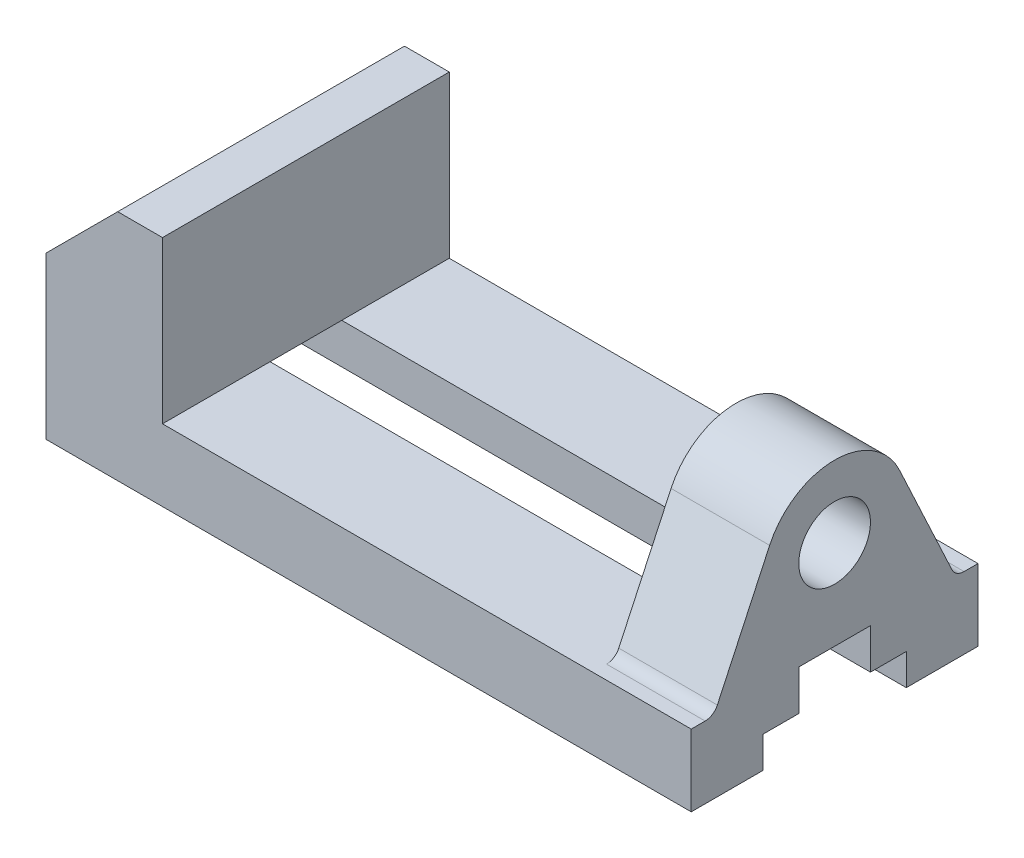
ISO-10303-21;
HEADER;
FILE_DESCRIPTION(('STEP AP214'),'2;1');
FILE_NAME('part.step','',(''),(''),'','','');
FILE_SCHEMA(('AUTOMOTIVE_DESIGN { 1 0 10303 214 1 1 1 1 }'));
ENDSEC;
DATA;
#1=APPLICATION_CONTEXT('core data for automotive mechanical design processes');
#2=APPLICATION_PROTOCOL_DEFINITION('international standard','automotive_design',2000,#1);
#3=PRODUCT_CONTEXT('',#1,'mechanical');
#4=PRODUCT('Part','Part','',(#3));
#5=PRODUCT_RELATED_PRODUCT_CATEGORY('part','',(#4));
#6=PRODUCT_DEFINITION_FORMATION('','',#4);
#7=PRODUCT_DEFINITION_CONTEXT('part definition',#1,'design');
#8=PRODUCT_DEFINITION('design','',#6,#7);
#9=PRODUCT_DEFINITION_SHAPE('','',#8);
#10=(LENGTH_UNIT() NAMED_UNIT(*) SI_UNIT(.MILLI.,.METRE.));
#11=(NAMED_UNIT(*) PLANE_ANGLE_UNIT() SI_UNIT($,.RADIAN.));
#12=(NAMED_UNIT(*) SI_UNIT($,.STERADIAN.) SOLID_ANGLE_UNIT());
#13=UNCERTAINTY_MEASURE_WITH_UNIT(LENGTH_MEASURE(1.E-05),#10,'distance_accuracy_value','');
#14=(GEOMETRIC_REPRESENTATION_CONTEXT(3) GLOBAL_UNCERTAINTY_ASSIGNED_CONTEXT((#13)) GLOBAL_UNIT_ASSIGNED_CONTEXT((#10,
#11,#12)) REPRESENTATION_CONTEXT('',''));
#15=CARTESIAN_POINT('',(0.,0.,0.));
#16=DIRECTION('',(0.,0.,1.));
#17=DIRECTION('',(1.,0.,0.));
#18=AXIS2_PLACEMENT_3D('',#15,#16,#17);
#19=CARTESIAN_POINT('',(0.,0.,64.));
#20=DIRECTION('',(0.,1.,0.));
#21=DIRECTION('',(0.,0.,1.));
#22=AXIS2_PLACEMENT_3D('',#19,#20,#21);
#23=PLANE('',#22);
#24=CARTESIAN_POINT('',(106.,0.,54.));
#25=DIRECTION('',(0.,-1.,0.));
#26=DIRECTION('',(0.,0.,-1.));
#27=AXIS2_PLACEMENT_3D('',#24,#25,#26);
#28=CIRCLE('',#27,3.00000000000001);
#29=CARTESIAN_POINT('',(106.,0.,51.));
#30=VERTEX_POINT('',#29);
#31=EDGE_CURVE('E417',#30,#30,#28,.T.);
#32=ORIENTED_EDGE('',*,*,#31,.F.);
#33=EDGE_LOOP('',(#32));
#34=FACE_BOUND('',#33,.T.);
#35=CARTESIAN_POINT('',(36.,0.,54.));
#36=DIRECTION('',(0.,-1.,0.));
#37=DIRECTION('',(0.,0.,-1.));
#38=AXIS2_PLACEMENT_3D('',#35,#36,#37);
#39=CIRCLE('',#38,3.);
#40=CARTESIAN_POINT('',(36.,0.,51.));
#41=VERTEX_POINT('',#40);
#42=EDGE_CURVE('E414',#41,#41,#39,.T.);
#43=ORIENTED_EDGE('',*,*,#42,.F.);
#44=EDGE_LOOP('',(#43));
#45=FACE_BOUND('',#44,.T.);
#46=DIRECTION('',(0.,0.,-1.));
#47=VECTOR('',#46,1.);
#48=CARTESIAN_POINT('',(0.,0.,64.));
#49=LINE('',#48,#47);
#50=CARTESIAN_POINT('',(0.,0.,64.));
#51=VERTEX_POINT('',#50);
#52=CARTESIAN_POINT('',(0.,0.,48.));
#53=VERTEX_POINT('',#52);
#54=EDGE_CURVE('E251',#51,#53,#49,.T.);
#55=ORIENTED_EDGE('',*,*,#54,.T.);
#56=DIRECTION('',(1.,0.,0.));
#57=VECTOR('',#56,1.);
#58=CARTESIAN_POINT('',(-0.001000000000001,0.,48.));
#59=LINE('',#58,#57);
#60=CARTESIAN_POINT('',(144.,0.,48.));
#61=VERTEX_POINT('',#60);
#62=EDGE_CURVE('E233',#53,#61,#59,.T.);
#63=ORIENTED_EDGE('',*,*,#62,.T.);
#64=DIRECTION('',(0.,0.,-1.));
#65=VECTOR('',#64,1.);
#66=CARTESIAN_POINT('',(144.,0.,64.));
#67=LINE('',#66,#65);
#68=CARTESIAN_POINT('',(144.,0.,64.));
#69=VERTEX_POINT('',#68);
#70=EDGE_CURVE('E260',#69,#61,#67,.T.);
#71=ORIENTED_EDGE('',*,*,#70,.F.);
#72=DIRECTION('',(1.,0.,0.));
#73=VECTOR('',#72,1.);
#74=CARTESIAN_POINT('',(0.,0.,64.));
#75=LINE('',#74,#73);
#76=EDGE_CURVE('E256',#51,#69,#75,.T.);
#77=ORIENTED_EDGE('',*,*,#76,.F.);
#78=EDGE_LOOP('',(#55,#63,#71,#77));
#79=FACE_BOUND('',#78,.T.);
#80=ADVANCED_FACE('F79',(#34,#45,#79),#23,.F.);
#81=CARTESIAN_POINT('',(122.,16.,64.));
#82=DIRECTION('',(0.,-1.,0.));
#83=DIRECTION('',(1.,0.,0.));
#84=AXIS2_PLACEMENT_3D('',#81,#82,#83);
#85=PLANE('',#84);
#86=DIRECTION('',(0.,0.,-1.));
#87=VECTOR('',#86,1.);
#88=CARTESIAN_POINT('',(122.,16.,64.));
#89=LINE('',#88,#87);
#90=CARTESIAN_POINT('',(122.,16.,60.8914106489224));
#91=VERTEX_POINT('',#90);
#92=CARTESIAN_POINT('',(122.,16.,40.));
#93=VERTEX_POINT('',#92);
#94=EDGE_CURVE('E264',#91,#93,#89,.T.);
#95=ORIENTED_EDGE('',*,*,#94,.T.);
#96=DIRECTION('',(1.,0.,0.));
#97=VECTOR('',#96,1.);
#98=CARTESIAN_POINT('',(-0.001000000000001,16.,40.));
#99=LINE('',#98,#97);
#100=CARTESIAN_POINT('',(26.,16.,40.));
#101=VERTEX_POINT('',#100);
#102=EDGE_CURVE('E379',#101,#93,#99,.T.);
#103=ORIENTED_EDGE('',*,*,#102,.F.);
#104=DIRECTION('',(0.,0.,-1.));
#105=VECTOR('',#104,1.);
#106=CARTESIAN_POINT('',(26.,16.,64.));
#107=LINE('',#106,#105);
#108=CARTESIAN_POINT('',(26.,16.,64.));
#109=VERTEX_POINT('',#108);
#110=EDGE_CURVE('E268',#109,#101,#107,.T.);
#111=ORIENTED_EDGE('',*,*,#110,.F.);
#112=DIRECTION('',(-1.,0.,0.));
#113=VECTOR('',#112,1.);
#114=CARTESIAN_POINT('',(122.,16.,64.));
#115=LINE('',#114,#113);
#116=CARTESIAN_POINT('',(144.,16.,64.));
#117=VERTEX_POINT('',#116);
#118=EDGE_CURVE('E308',#117,#109,#115,.T.);
#119=ORIENTED_EDGE('',*,*,#118,.F.);
#120=DIRECTION('',(0.,0.,-1.));
#121=VECTOR('',#120,1.);
#122=CARTESIAN_POINT('',(144.,16.,0.));
#123=LINE('',#122,#121);
#124=CARTESIAN_POINT('',(144.,16.,60.8914106489224));
#125=VERTEX_POINT('',#124);
#126=EDGE_CURVE('E332',#117,#125,#123,.T.);
#127=ORIENTED_EDGE('',*,*,#126,.T.);
#128=DIRECTION('',(1.,0.,0.));
#129=VECTOR('',#128,1.);
#130=CARTESIAN_POINT('',(80.,16.,60.8914106489224));
#131=LINE('',#130,#129);
#132=EDGE_CURVE('E318',#91,#125,#131,.T.);
#133=ORIENTED_EDGE('',*,*,#132,.F.);
#134=EDGE_LOOP('',(#95,#103,#111,#119,#127,#133));
#135=FACE_BOUND('',#134,.T.);
#136=ADVANCED_FACE('F493',(#135),#85,.F.);
#137=CARTESIAN_POINT('',(122.,52.,64.));
#138=DIRECTION('',(1.,0.,0.));
#139=DIRECTION('',(0.,0.,-1.));
#140=AXIS2_PLACEMENT_3D('',#137,#138,#139);
#141=PLANE('',#140);
#142=CARTESIAN_POINT('',(122.,36.,32.));
#143=DIRECTION('',(1.,0.,0.));
#144=DIRECTION('',(0.,0.,-1.));
#145=AXIS2_PLACEMENT_3D('',#142,#143,#144);
#146=CIRCLE('',#145,8.);
#147=CARTESIAN_POINT('',(122.,36.,24.));
#148=VERTEX_POINT('',#147);
#149=EDGE_CURVE('E335',#148,#148,#146,.T.);
#150=ORIENTED_EDGE('',*,*,#149,.T.);
#151=EDGE_LOOP('',(#150));
#152=FACE_BOUND('',#151,.T.);
#153=CARTESIAN_POINT('',(122.,19.,3.10858935107765));
#154=DIRECTION('',(1.,0.,0.));
#155=DIRECTION('',(0.,0.,-1.));
#156=AXIS2_PLACEMENT_3D('',#153,#154,#155);
#157=CIRCLE('',#156,3.);
#158=CARTESIAN_POINT('',(122.,16.,3.10858935107763));
#159=VERTEX_POINT('',#158);
#160=CARTESIAN_POINT('',(122.,17.7321452147779,5.8275127121876));
#161=VERTEX_POINT('',#160);
#162=EDGE_CURVE('E341',#159,#161,#157,.F.);
#163=ORIENTED_EDGE('',*,*,#162,.F.);
#164=CARTESIAN_POINT('',(122.,16.,24.));
#165=VERTEX_POINT('',#164);
#166=EDGE_CURVE('E267',#165,#159,#89,.T.);
#167=ORIENTED_EDGE('',*,*,#166,.F.);
#168=DIRECTION('',(0.,0.,1.));
#169=VECTOR('',#168,1.);
#170=CARTESIAN_POINT('',(122.,16.,64.));
#171=LINE('',#170,#169);
#172=EDGE_CURVE('E362',#165,#93,#171,.T.);
#173=ORIENTED_EDGE('',*,*,#172,.T.);
#174=ORIENTED_EDGE('',*,*,#94,.F.);
#175=CARTESIAN_POINT('',(122.,19.,60.8914106489224));
#176=DIRECTION('',(1.,0.,0.));
#177=DIRECTION('',(0.,0.,-1.));
#178=AXIS2_PLACEMENT_3D('',#175,#176,#177);
#179=CIRCLE('',#178,3.);
#180=CARTESIAN_POINT('',(122.,17.7321452147779,58.1724872878124));
#181=VERTEX_POINT('',#180);
#182=EDGE_CURVE('E302',#91,#181,#179,.T.);
#183=ORIENTED_EDGE('',*,*,#182,.T.);
#184=DIRECTION('',(0.,-0.906307787036649,0.422618261740701));
#185=VECTOR('',#184,1.);
#186=CARTESIAN_POINT('',(122.,43.6474819754398,46.08796729265));
#187=LINE('',#186,#185);
#188=CARTESIAN_POINT('',(122.,42.7618921878512,46.5009245925864));
#189=VERTEX_POINT('',#188);
#190=EDGE_CURVE('E87',#189,#181,#187,.T.);
#191=ORIENTED_EDGE('',*,*,#190,.F.);
#192=CARTESIAN_POINT('',(122.,36.,32.));
#193=DIRECTION('',(1.,0.,0.));
#194=DIRECTION('',(0.,0.,-1.));
#195=AXIS2_PLACEMENT_3D('',#192,#193,#194);
#196=CIRCLE('',#195,16.);
#197=CARTESIAN_POINT('',(122.,42.7618921878512,17.4990754074136));
#198=VERTEX_POINT('',#197);
#199=EDGE_CURVE('E12',#198,#189,#196,.T.);
#200=ORIENTED_EDGE('',*,*,#199,.F.);
#201=DIRECTION('',(0.,-0.906307787036649,-0.422618261740701));
#202=VECTOR('',#201,1.);
#203=CARTESIAN_POINT('',(122.,68.1609041552472,29.3428291973809));
#204=LINE('',#203,#202);
#205=EDGE_CURVE('E338',#198,#161,#204,.T.);
#206=ORIENTED_EDGE('',*,*,#205,.T.);
#207=EDGE_LOOP('',(#163,#167,#173,#174,#183,#191,#200,#206));
#208=FACE_BOUND('',#207,.T.);
#209=ADVANCED_FACE('F542',(#152,#208),#141,.F.);
#210=CARTESIAN_POINT('',(144.,0.,64.));
#211=DIRECTION('',(-1.,0.,0.));
#212=DIRECTION('',(0.,0.,1.));
#213=AXIS2_PLACEMENT_3D('',#210,#211,#212);
#214=PLANE('',#213);
#215=CARTESIAN_POINT('',(144.,36.,32.));
#216=DIRECTION('',(1.,0.,0.));
#217=DIRECTION('',(0.,0.,-1.));
#218=AXIS2_PLACEMENT_3D('',#215,#216,#217);
#219=CIRCLE('',#218,8.);
#220=CARTESIAN_POINT('',(144.,36.,24.));
#221=VERTEX_POINT('',#220);
#222=EDGE_CURVE('E359',#221,#221,#219,.T.);
#223=ORIENTED_EDGE('',*,*,#222,.F.);
#224=EDGE_LOOP('',(#223));
#225=FACE_BOUND('',#224,.T.);
#226=DIRECTION('',(0.,0.,1.));
#227=VECTOR('',#226,1.);
#228=CARTESIAN_POINT('',(144.,7.,24.));
#229=LINE('',#228,#227);
#230=CARTESIAN_POINT('',(144.,7.,16.));
#231=VERTEX_POINT('',#230);
#232=CARTESIAN_POINT('',(144.,7.,24.));
#233=VERTEX_POINT('',#232);
#234=EDGE_CURVE('E393',#231,#233,#229,.T.);
#235=ORIENTED_EDGE('',*,*,#234,.F.);
#236=DIRECTION('',(0.,1.,0.));
#237=VECTOR('',#236,1.);
#238=CARTESIAN_POINT('',(144.,0.,16.));
#239=LINE('',#238,#237);
#240=CARTESIAN_POINT('',(144.,0.,16.));
#241=VERTEX_POINT('',#240);
#242=EDGE_CURVE('E396',#241,#231,#239,.T.);
#243=ORIENTED_EDGE('',*,*,#242,.F.);
#244=CARTESIAN_POINT('',(144.,0.,0.));
#245=VERTEX_POINT('',#244);
#246=EDGE_CURVE('E263',#241,#245,#67,.T.);
#247=ORIENTED_EDGE('',*,*,#246,.T.);
#248=DIRECTION('',(0.,1.,0.));
#249=VECTOR('',#248,1.);
#250=CARTESIAN_POINT('',(144.,0.,0.));
#251=LINE('',#250,#249);
#252=CARTESIAN_POINT('',(144.,16.,0.));
#253=VERTEX_POINT('',#252);
#254=EDGE_CURVE('E293',#245,#253,#251,.T.);
#255=ORIENTED_EDGE('',*,*,#254,.T.);
#256=DIRECTION('',(0.,0.,-1.));
#257=VECTOR('',#256,1.);
#258=CARTESIAN_POINT('',(144.,16.,0.));
#259=LINE('',#258,#257);
#260=CARTESIAN_POINT('',(144.,16.,3.10858935107763));
#261=VERTEX_POINT('',#260);
#262=EDGE_CURVE('E353',#261,#253,#259,.T.);
#263=ORIENTED_EDGE('',*,*,#262,.F.);
#264=CARTESIAN_POINT('',(144.,19.,3.10858935107765));
#265=DIRECTION('',(1.,0.,0.));
#266=DIRECTION('',(0.,0.,-1.));
#267=AXIS2_PLACEMENT_3D('',#264,#265,#266);
#268=CIRCLE('',#267,3.);
#269=CARTESIAN_POINT('',(144.,17.7321452147779,5.8275127121876));
#270=VERTEX_POINT('',#269);
#271=EDGE_CURVE('E356',#261,#270,#268,.F.);
#272=ORIENTED_EDGE('',*,*,#271,.T.);
#273=DIRECTION('',(0.,-0.906307787036649,-0.422618261740701));
#274=VECTOR('',#273,1.);
#275=CARTESIAN_POINT('',(144.,0.93500412358986,-2.00512281374342));
#276=LINE('',#275,#274);
#277=CARTESIAN_POINT('',(144.,42.7618921878512,17.4990754074136));
#278=VERTEX_POINT('',#277);
#279=EDGE_CURVE('E347',#278,#270,#276,.T.);
#280=ORIENTED_EDGE('',*,*,#279,.F.);
#281=CARTESIAN_POINT('',(144.,36.,32.));
#282=DIRECTION('',(1.,0.,0.));
#283=DIRECTION('',(0.,0.,-1.));
#284=AXIS2_PLACEMENT_3D('',#281,#282,#283);
#285=CIRCLE('',#284,16.);
#286=CARTESIAN_POINT('',(144.,42.7618921878512,46.5009245925864));
#287=VERTEX_POINT('',#286);
#288=EDGE_CURVE('E321',#278,#287,#285,.T.);
#289=ORIENTED_EDGE('',*,*,#288,.T.);
#290=DIRECTION('',(0.,-0.906307787036649,0.422618261740701));
#291=VECTOR('',#290,1.);
#292=CARTESIAN_POINT('',(144.,25.4484263033972,54.5743263237126));
#293=LINE('',#292,#291);
#294=CARTESIAN_POINT('',(144.,17.7321452147779,58.1724872878124));
#295=VERTEX_POINT('',#294);
#296=EDGE_CURVE('E326',#287,#295,#293,.T.);
#297=ORIENTED_EDGE('',*,*,#296,.T.);
#298=CARTESIAN_POINT('',(144.,19.,60.8914106489224));
#299=DIRECTION('',(1.,0.,0.));
#300=DIRECTION('',(0.,0.,-1.));
#301=AXIS2_PLACEMENT_3D('',#298,#299,#300);
#302=CIRCLE('',#301,3.);
#303=EDGE_CURVE('E329',#125,#295,#302,.T.);
#304=ORIENTED_EDGE('',*,*,#303,.F.);
#305=ORIENTED_EDGE('',*,*,#126,.F.);
#306=DIRECTION('',(0.,1.,0.));
#307=VECTOR('',#306,1.);
#308=CARTESIAN_POINT('',(144.,0.,64.));
#309=LINE('',#308,#307);
#310=EDGE_CURVE('E310',#69,#117,#309,.T.);
#311=ORIENTED_EDGE('',*,*,#310,.F.);
#312=ORIENTED_EDGE('',*,*,#70,.T.);
#313=DIRECTION('',(0.,-1.,0.));
#314=VECTOR('',#313,1.);
#315=CARTESIAN_POINT('',(144.,0.,48.));
#316=LINE('',#315,#314);
#317=CARTESIAN_POINT('',(144.,7.,48.));
#318=VERTEX_POINT('',#317);
#319=EDGE_CURVE('E239',#318,#61,#316,.T.);
#320=ORIENTED_EDGE('',*,*,#319,.F.);
#321=DIRECTION('',(0.,0.,1.));
#322=VECTOR('',#321,1.);
#323=CARTESIAN_POINT('',(144.,7.,48.));
#324=LINE('',#323,#322);
#325=CARTESIAN_POINT('',(144.,7.,40.));
#326=VERTEX_POINT('',#325);
#327=EDGE_CURVE('E245',#326,#318,#324,.T.);
#328=ORIENTED_EDGE('',*,*,#327,.F.);
#329=DIRECTION('',(0.,-1.,0.));
#330=VECTOR('',#329,1.);
#331=CARTESIAN_POINT('',(144.,7.,40.));
#332=LINE('',#331,#330);
#333=CARTESIAN_POINT('',(144.,16.,40.));
#334=VERTEX_POINT('',#333);
#335=EDGE_CURVE('E384',#334,#326,#332,.T.);
#336=ORIENTED_EDGE('',*,*,#335,.F.);
#337=DIRECTION('',(0.,0.,1.));
#338=VECTOR('',#337,1.);
#339=CARTESIAN_POINT('',(144.,16.,40.));
#340=LINE('',#339,#338);
#341=CARTESIAN_POINT('',(144.,16.,24.));
#342=VERTEX_POINT('',#341);
#343=EDGE_CURVE('E387',#342,#334,#340,.T.);
#344=ORIENTED_EDGE('',*,*,#343,.F.);
#345=DIRECTION('',(0.,1.,0.));
#346=VECTOR('',#345,1.);
#347=CARTESIAN_POINT('',(144.,16.,24.));
#348=LINE('',#347,#346);
#349=EDGE_CURVE('E390',#233,#342,#348,.T.);
#350=ORIENTED_EDGE('',*,*,#349,.F.);
#351=EDGE_LOOP('',(#235,#243,#247,#255,#263,#272,#280,#289,#297,#304,#305,#311,#312,#320,#328,
#336,#344,#350));
#352=FACE_BOUND('',#351,.T.);
#353=ADVANCED_FACE('F451',(#225,#352),#214,.F.);
#354=CARTESIAN_POINT('',(0.,36.,64.));
#355=DIRECTION('',(1.,0.,0.));
#356=DIRECTION('',(0.,1.,0.));
#357=AXIS2_PLACEMENT_3D('',#354,#355,#356);
#358=PLANE('',#357);
#359=CARTESIAN_POINT('',(0.,0.,16.));
#360=VERTEX_POINT('',#359);
#361=CARTESIAN_POINT('',(0.,0.,0.));
#362=VERTEX_POINT('',#361);
#363=EDGE_CURVE('E258',#360,#362,#49,.T.);
#364=ORIENTED_EDGE('',*,*,#363,.F.);
#365=DIRECTION('',(0.,-1.,0.));
#366=VECTOR('',#365,1.);
#367=CARTESIAN_POINT('',(0.,0.,16.));
#368=LINE('',#367,#366);
#369=CARTESIAN_POINT('',(0.,7.,16.));
#370=VERTEX_POINT('',#369);
#371=EDGE_CURVE('E94',#370,#360,#368,.T.);
#372=ORIENTED_EDGE('',*,*,#371,.F.);
#373=DIRECTION('',(0.,0.,-1.));
#374=VECTOR('',#373,1.);
#375=CARTESIAN_POINT('',(0.,7.,24.));
#376=LINE('',#375,#374);
#377=CARTESIAN_POINT('',(0.,7.,24.));
#378=VERTEX_POINT('',#377);
#379=EDGE_CURVE('E409',#378,#370,#376,.T.);
#380=ORIENTED_EDGE('',*,*,#379,.F.);
#381=DIRECTION('',(0.,-1.,0.));
#382=VECTOR('',#381,1.);
#383=CARTESIAN_POINT('',(0.,16.,24.));
#384=LINE('',#383,#382);
#385=CARTESIAN_POINT('',(0.,16.,24.));
#386=VERTEX_POINT('',#385);
#387=EDGE_CURVE('E406',#386,#378,#384,.T.);
#388=ORIENTED_EDGE('',*,*,#387,.F.);
#389=DIRECTION('',(0.,0.,-1.));
#390=VECTOR('',#389,1.);
#391=CARTESIAN_POINT('',(0.,16.,40.));
#392=LINE('',#391,#390);
#393=CARTESIAN_POINT('',(0.,16.,40.));
#394=VERTEX_POINT('',#393);
#395=EDGE_CURVE('E404',#394,#386,#392,.T.);
#396=ORIENTED_EDGE('',*,*,#395,.F.);
#397=DIRECTION('',(0.,1.,0.));
#398=VECTOR('',#397,1.);
#399=CARTESIAN_POINT('',(0.,7.,40.));
#400=LINE('',#399,#398);
#401=CARTESIAN_POINT('',(0.,7.,40.));
#402=VERTEX_POINT('',#401);
#403=EDGE_CURVE('E401',#402,#394,#400,.T.);
#404=ORIENTED_EDGE('',*,*,#403,.F.);
#405=DIRECTION('',(0.,0.,-1.));
#406=VECTOR('',#405,1.);
#407=CARTESIAN_POINT('',(0.,7.,48.));
#408=LINE('',#407,#406);
#409=CARTESIAN_POINT('',(0.,7.,48.));
#410=VERTEX_POINT('',#409);
#411=EDGE_CURVE('E254',#410,#402,#408,.T.);
#412=ORIENTED_EDGE('',*,*,#411,.F.);
#413=DIRECTION('',(0.,1.,0.));
#414=VECTOR('',#413,1.);
#415=CARTESIAN_POINT('',(0.,0.,48.));
#416=LINE('',#415,#414);
#417=EDGE_CURVE('E236',#53,#410,#416,.T.);
#418=ORIENTED_EDGE('',*,*,#417,.F.);
#419=ORIENTED_EDGE('',*,*,#54,.F.);
#420=DIRECTION('',(0.,-1.,0.));
#421=VECTOR('',#420,1.);
#422=CARTESIAN_POINT('',(0.,36.,64.));
#423=LINE('',#422,#421);
#424=CARTESIAN_POINT('',(0.,36.,64.));
#425=VERTEX_POINT('',#424);
#426=EDGE_CURVE('E285',#425,#51,#423,.T.);
#427=ORIENTED_EDGE('',*,*,#426,.F.);
#428=DIRECTION('',(0.,0.,-1.));
#429=VECTOR('',#428,1.);
#430=CARTESIAN_POINT('',(0.,36.,64.));
#431=LINE('',#430,#429);
#432=CARTESIAN_POINT('',(0.,36.,0.));
#433=VERTEX_POINT('',#432);
#434=EDGE_CURVE('E279',#425,#433,#431,.T.);
#435=ORIENTED_EDGE('',*,*,#434,.T.);
#436=DIRECTION('',(0.,-1.,0.));
#437=VECTOR('',#436,1.);
#438=CARTESIAN_POINT('',(0.,36.,0.));
#439=LINE('',#438,#437);
#440=EDGE_CURVE('E299',#433,#362,#439,.T.);
#441=ORIENTED_EDGE('',*,*,#440,.T.);
#442=EDGE_LOOP('',(#364,#372,#380,#388,#396,#404,#412,#418,#419,#427,#435,#441));
#443=FACE_BOUND('',#442,.T.);
#444=ADVANCED_FACE('F81',(#443),#358,.F.);
#445=CARTESIAN_POINT('',(36.,0.,10.));
#446=DIRECTION('',(0.,-1.,0.));
#447=DIRECTION('',(0.,0.,-1.));
#448=AXIS2_PLACEMENT_3D('',#445,#446,#447);
#449=CIRCLE('',#448,3.);
#450=CARTESIAN_POINT('',(36.,0.,7.));
#451=VERTEX_POINT('',#450);
#452=EDGE_CURVE('E423',#451,#451,#449,.T.);
#453=ORIENTED_EDGE('',*,*,#452,.F.);
#454=EDGE_LOOP('',(#453));
#455=FACE_BOUND('',#454,.T.);
#456=CARTESIAN_POINT('',(106.,0.,10.));
#457=DIRECTION('',(0.,-1.,0.));
#458=DIRECTION('',(0.,0.,-1.));
#459=AXIS2_PLACEMENT_3D('',#456,#457,#458);
#460=CIRCLE('',#459,3.00000000000001);
#461=CARTESIAN_POINT('',(106.,0.,6.99999999999999));
#462=VERTEX_POINT('',#461);
#463=EDGE_CURVE('E424',#462,#462,#460,.T.);
#464=ORIENTED_EDGE('',*,*,#463,.F.);
#465=EDGE_LOOP('',(#464));
#466=FACE_BOUND('',#465,.T.);
#467=ORIENTED_EDGE('',*,*,#246,.F.);
#468=DIRECTION('',(1.,0.,0.));
#469=VECTOR('',#468,1.);
#470=CARTESIAN_POINT('',(-0.001000000000001,0.,16.));
#471=LINE('',#470,#469);
#472=EDGE_CURVE('E244',#360,#241,#471,.T.);
#473=ORIENTED_EDGE('',*,*,#472,.F.);
#474=ORIENTED_EDGE('',*,*,#363,.T.);
#475=DIRECTION('',(1.,0.,0.));
#476=VECTOR('',#475,1.);
#477=CARTESIAN_POINT('',(0.,0.,0.));
#478=LINE('',#477,#476);
#479=EDGE_CURVE('E296',#362,#245,#478,.T.);
#480=ORIENTED_EDGE('',*,*,#479,.T.);
#481=EDGE_LOOP('',(#467,#473,#474,#480));
#482=FACE_BOUND('',#481,.T.);
#483=ADVANCED_FACE('F440',(#455,#466,#482),#23,.F.);
#484=CARTESIAN_POINT('',(26.,16.,24.));
#485=VERTEX_POINT('',#484);
#486=CARTESIAN_POINT('',(26.,16.,0.));
#487=VERTEX_POINT('',#486);
#488=EDGE_CURVE('E272',#485,#487,#107,.T.);
#489=ORIENTED_EDGE('',*,*,#488,.F.);
#490=DIRECTION('',(1.,0.,0.));
#491=VECTOR('',#490,1.);
#492=CARTESIAN_POINT('',(-0.001000000000001,16.,24.));
#493=LINE('',#492,#491);
#494=EDGE_CURVE('E374',#485,#165,#493,.T.);
#495=ORIENTED_EDGE('',*,*,#494,.T.);
#496=ORIENTED_EDGE('',*,*,#166,.T.);
#497=DIRECTION('',(1.,0.,0.));
#498=VECTOR('',#497,1.);
#499=CARTESIAN_POINT('',(80.,16.,3.10858935107763));
#500=LINE('',#499,#498);
#501=EDGE_CURVE('E344',#159,#261,#500,.T.);
#502=ORIENTED_EDGE('',*,*,#501,.T.);
#503=ORIENTED_EDGE('',*,*,#262,.T.);
#504=DIRECTION('',(-1.,0.,0.));
#505=VECTOR('',#504,1.);
#506=CARTESIAN_POINT('',(122.,16.,0.));
#507=LINE('',#506,#505);
#508=EDGE_CURVE('E290',#253,#487,#507,.T.);
#509=ORIENTED_EDGE('',*,*,#508,.T.);
#510=EDGE_LOOP('',(#489,#495,#496,#502,#503,#509));
#511=FACE_BOUND('',#510,.T.);
#512=ADVANCED_FACE('F443',(#511),#85,.F.);
#513=CARTESIAN_POINT('',(26.,16.,64.));
#514=DIRECTION('',(-1.,0.,0.));
#515=DIRECTION('',(0.,0.,1.));
#516=AXIS2_PLACEMENT_3D('',#513,#514,#515);
#517=PLANE('',#516);
#518=DIRECTION('',(0.,1.,0.));
#519=VECTOR('',#518,1.);
#520=CARTESIAN_POINT('',(26.,16.,0.));
#521=LINE('',#520,#519);
#522=CARTESIAN_POINT('',(26.,52.,0.));
#523=VERTEX_POINT('',#522);
#524=EDGE_CURVE('E288',#487,#523,#521,.T.);
#525=ORIENTED_EDGE('',*,*,#524,.T.);
#526=DIRECTION('',(0.,0.,-1.));
#527=VECTOR('',#526,1.);
#528=CARTESIAN_POINT('',(26.,52.,64.));
#529=LINE('',#528,#527);
#530=CARTESIAN_POINT('',(26.,52.,64.));
#531=VERTEX_POINT('',#530);
#532=EDGE_CURVE('E273',#531,#523,#529,.T.);
#533=ORIENTED_EDGE('',*,*,#532,.F.);
#534=DIRECTION('',(0.,1.,0.));
#535=VECTOR('',#534,1.);
#536=CARTESIAN_POINT('',(26.,16.,64.));
#537=LINE('',#536,#535);
#538=EDGE_CURVE('E306',#109,#531,#537,.T.);
#539=ORIENTED_EDGE('',*,*,#538,.F.);
#540=ORIENTED_EDGE('',*,*,#110,.T.);
#541=EDGE_CURVE('E271',#101,#485,#107,.T.);
#542=ORIENTED_EDGE('',*,*,#541,.T.);
#543=ORIENTED_EDGE('',*,*,#488,.T.);
#544=EDGE_LOOP('',(#525,#533,#539,#540,#542,#543));
#545=FACE_BOUND('',#544,.T.);
#546=ADVANCED_FACE('F518',(#545),#517,.F.);
#547=CARTESIAN_POINT('',(26.,52.,64.));
#548=DIRECTION('',(0.,-1.,0.));
#549=DIRECTION('',(1.,0.,0.));
#550=AXIS2_PLACEMENT_3D('',#547,#548,#549);
#551=PLANE('',#550);
#552=DIRECTION('',(-1.,0.,0.));
#553=VECTOR('',#552,1.);
#554=CARTESIAN_POINT('',(26.,52.,0.));
#555=LINE('',#554,#553);
#556=CARTESIAN_POINT('',(16.,52.,0.));
#557=VERTEX_POINT('',#556);
#558=EDGE_CURVE('E286',#523,#557,#555,.T.);
#559=ORIENTED_EDGE('',*,*,#558,.T.);
#560=DIRECTION('',(0.,0.,-1.));
#561=VECTOR('',#560,1.);
#562=CARTESIAN_POINT('',(16.,52.,64.));
#563=LINE('',#562,#561);
#564=CARTESIAN_POINT('',(16.,52.,64.));
#565=VERTEX_POINT('',#564);
#566=EDGE_CURVE('E276',#565,#557,#563,.T.);
#567=ORIENTED_EDGE('',*,*,#566,.F.);
#568=DIRECTION('',(-1.,0.,0.));
#569=VECTOR('',#568,1.);
#570=CARTESIAN_POINT('',(26.,52.,64.));
#571=LINE('',#570,#569);
#572=EDGE_CURVE('E304',#531,#565,#571,.T.);
#573=ORIENTED_EDGE('',*,*,#572,.F.);
#574=ORIENTED_EDGE('',*,*,#532,.T.);
#575=EDGE_LOOP('',(#559,#567,#573,#574));
#576=FACE_BOUND('',#575,.T.);
#577=ADVANCED_FACE('F525',(#576),#551,.F.);
#578=CARTESIAN_POINT('',(16.,52.,64.));
#579=DIRECTION('',(0.707106781186547,-0.707106781186547,0.));
#580=DIRECTION('',(0.707106781186548,0.707106781186548,0.));
#581=AXIS2_PLACEMENT_3D('',#578,#579,#580);
#582=PLANE('',#581);
#583=DIRECTION('',(-0.707106781186548,-0.707106781186548,0.));
#584=VECTOR('',#583,1.);
#585=CARTESIAN_POINT('',(16.,52.,0.));
#586=LINE('',#585,#584);
#587=EDGE_CURVE('E283',#557,#433,#586,.T.);
#588=ORIENTED_EDGE('',*,*,#587,.T.);
#589=ORIENTED_EDGE('',*,*,#434,.F.);
#590=DIRECTION('',(-0.707106781186548,-0.707106781186548,0.));
#591=VECTOR('',#590,1.);
#592=CARTESIAN_POINT('',(16.,52.,64.));
#593=LINE('',#592,#591);
#594=EDGE_CURVE('E282',#565,#425,#593,.T.);
#595=ORIENTED_EDGE('',*,*,#594,.F.);
#596=ORIENTED_EDGE('',*,*,#566,.T.);
#597=EDGE_LOOP('',(#588,#589,#595,#596));
#598=FACE_BOUND('',#597,.T.);
#599=ADVANCED_FACE('F527',(#598),#582,.F.);
#600=CARTESIAN_POINT('',(0.,0.,64.));
#601=DIRECTION('',(0.,0.,1.));
#602=DIRECTION('',(1.,0.,0.));
#603=AXIS2_PLACEMENT_3D('',#600,#601,#602);
#604=PLANE('',#603);
#605=ORIENTED_EDGE('',*,*,#310,.T.);
#606=ORIENTED_EDGE('',*,*,#118,.T.);
#607=ORIENTED_EDGE('',*,*,#538,.T.);
#608=ORIENTED_EDGE('',*,*,#572,.T.);
#609=ORIENTED_EDGE('',*,*,#594,.T.);
#610=ORIENTED_EDGE('',*,*,#426,.T.);
#611=ORIENTED_EDGE('',*,*,#76,.T.);
#612=EDGE_LOOP('',(#605,#606,#607,#608,#609,#610,#611));
#613=FACE_BOUND('',#612,.T.);
#614=ADVANCED_FACE('F497',(#613),#604,.T.);
#615=CARTESIAN_POINT('',(0.,0.,0.));
#616=DIRECTION('',(0.,0.,1.));
#617=DIRECTION('',(1.,0.,0.));
#618=AXIS2_PLACEMENT_3D('',#615,#616,#617);
#619=PLANE('',#618);
#620=ORIENTED_EDGE('',*,*,#508,.F.);
#621=ORIENTED_EDGE('',*,*,#254,.F.);
#622=ORIENTED_EDGE('',*,*,#479,.F.);
#623=ORIENTED_EDGE('',*,*,#440,.F.);
#624=ORIENTED_EDGE('',*,*,#587,.F.);
#625=ORIENTED_EDGE('',*,*,#558,.F.);
#626=ORIENTED_EDGE('',*,*,#524,.F.);
#627=EDGE_LOOP('',(#620,#621,#622,#623,#624,#625,#626));
#628=FACE_BOUND('',#627,.T.);
#629=ADVANCED_FACE('F461',(#628),#619,.F.);
#630=CARTESIAN_POINT('',(80.,36.,32.));
#631=DIRECTION('',(1.,0.,0.));
#632=DIRECTION('',(0.,0.,-1.));
#633=AXIS2_PLACEMENT_3D('',#630,#631,#632);
#634=CYLINDRICAL_SURFACE('',#633,16.);
#635=ORIENTED_EDGE('',*,*,#199,.T.);
#636=DIRECTION('',(1.,0.,0.));
#637=VECTOR('',#636,1.);
#638=CARTESIAN_POINT('',(80.,42.7618921878512,46.5009245925864));
#639=LINE('',#638,#637);
#640=EDGE_CURVE('E317',#189,#287,#639,.T.);
#641=ORIENTED_EDGE('',*,*,#640,.T.);
#642=ORIENTED_EDGE('',*,*,#288,.F.);
#643=DIRECTION('',(1.,0.,0.));
#644=VECTOR('',#643,1.);
#645=CARTESIAN_POINT('',(80.,42.7618921878512,17.4990754074136));
#646=LINE('',#645,#644);
#647=EDGE_CURVE('E346',#198,#278,#646,.T.);
#648=ORIENTED_EDGE('',*,*,#647,.F.);
#649=EDGE_LOOP('',(#635,#641,#642,#648));
#650=FACE_BOUND('',#649,.T.);
#651=ADVANCED_FACE('F479',(#650),#634,.T.);
#652=CARTESIAN_POINT('',(80.,25.4484263033972,54.5743263237126));
#653=DIRECTION('',(0.,0.422618261740701,0.906307787036649));
#654=DIRECTION('',(0.,-0.906307787036649,0.422618261740701));
#655=AXIS2_PLACEMENT_3D('',#652,#653,#654);
#656=PLANE('',#655);
#657=ORIENTED_EDGE('',*,*,#190,.T.);
#658=DIRECTION('',(1.,0.,0.));
#659=VECTOR('',#658,1.);
#660=CARTESIAN_POINT('',(80.,17.7321452147779,58.1724872878124));
#661=LINE('',#660,#659);
#662=EDGE_CURVE('E320',#181,#295,#661,.T.);
#663=ORIENTED_EDGE('',*,*,#662,.T.);
#664=ORIENTED_EDGE('',*,*,#296,.F.);
#665=ORIENTED_EDGE('',*,*,#640,.F.);
#666=EDGE_LOOP('',(#657,#663,#664,#665));
#667=FACE_BOUND('',#666,.T.);
#668=ADVANCED_FACE('F485',(#667),#656,.T.);
#669=CARTESIAN_POINT('',(80.,19.,60.8914106489224));
#670=DIRECTION('',(1.,0.,0.));
#671=DIRECTION('',(0.,0.,-1.));
#672=AXIS2_PLACEMENT_3D('',#669,#670,#671);
#673=CYLINDRICAL_SURFACE('',#672,3.);
#674=ORIENTED_EDGE('',*,*,#132,.T.);
#675=ORIENTED_EDGE('',*,*,#303,.T.);
#676=ORIENTED_EDGE('',*,*,#662,.F.);
#677=ORIENTED_EDGE('',*,*,#182,.F.);
#678=EDGE_LOOP('',(#674,#675,#676,#677));
#679=FACE_BOUND('',#678,.T.);
#680=ADVANCED_FACE('F489',(#679),#673,.F.);
#681=CARTESIAN_POINT('',(80.,0.93500412358986,-2.00512281374342));
#682=DIRECTION('',(0.,-0.422618261740701,0.906307787036649));
#683=DIRECTION('',(0.,-0.906307787036649,-0.422618261740701));
#684=AXIS2_PLACEMENT_3D('',#681,#682,#683);
#685=PLANE('',#684);
#686=ORIENTED_EDGE('',*,*,#647,.T.);
#687=ORIENTED_EDGE('',*,*,#279,.T.);
#688=DIRECTION('',(1.,0.,0.));
#689=VECTOR('',#688,1.);
#690=CARTESIAN_POINT('',(80.,17.7321452147779,5.8275127121876));
#691=LINE('',#690,#689);
#692=EDGE_CURVE('E343',#161,#270,#691,.T.);
#693=ORIENTED_EDGE('',*,*,#692,.F.);
#694=ORIENTED_EDGE('',*,*,#205,.F.);
#695=EDGE_LOOP('',(#686,#687,#693,#694));
#696=FACE_BOUND('',#695,.T.);
#697=ADVANCED_FACE('F476',(#696),#685,.F.);
#698=CARTESIAN_POINT('',(80.,19.,3.10858935107765));
#699=DIRECTION('',(1.,0.,0.));
#700=DIRECTION('',(0.,0.,-1.));
#701=AXIS2_PLACEMENT_3D('',#698,#699,#700);
#702=CYLINDRICAL_SURFACE('',#701,3.);
#703=ORIENTED_EDGE('',*,*,#162,.T.);
#704=ORIENTED_EDGE('',*,*,#692,.T.);
#705=ORIENTED_EDGE('',*,*,#271,.F.);
#706=ORIENTED_EDGE('',*,*,#501,.F.);
#707=EDGE_LOOP('',(#703,#704,#705,#706));
#708=FACE_BOUND('',#707,.T.);
#709=ADVANCED_FACE('F471',(#708),#702,.F.);
#710=CARTESIAN_POINT('',(80.,36.,32.));
#711=DIRECTION('',(1.,0.,0.));
#712=DIRECTION('',(0.,0.,-1.));
#713=AXIS2_PLACEMENT_3D('',#710,#711,#712);
#714=CYLINDRICAL_SURFACE('',#713,8.);
#715=ORIENTED_EDGE('',*,*,#222,.T.);
#716=EDGE_LOOP('',(#715));
#717=FACE_BOUND('',#716,.T.);
#718=ORIENTED_EDGE('',*,*,#149,.F.);
#719=EDGE_LOOP('',(#718));
#720=FACE_BOUND('',#719,.T.);
#721=ADVANCED_FACE('F631',(#717,#720),#714,.F.);
#722=CARTESIAN_POINT('',(-0.001000000000001,16.,40.));
#723=DIRECTION('',(0.,1.,0.));
#724=DIRECTION('',(0.,0.,1.));
#725=AXIS2_PLACEMENT_3D('',#722,#723,#724);
#726=PLANE('',#725);
#727=EDGE_CURVE('E371',#165,#342,#493,.T.);
#728=ORIENTED_EDGE('',*,*,#727,.T.);
#729=ORIENTED_EDGE('',*,*,#343,.T.);
#730=EDGE_CURVE('E373',#93,#334,#99,.T.);
#731=ORIENTED_EDGE('',*,*,#730,.F.);
#732=ORIENTED_EDGE('',*,*,#172,.F.);
#733=EDGE_LOOP('',(#728,#729,#731,#732));
#734=FACE_BOUND('',#733,.T.);
#735=ADVANCED_FACE('F508',(#734),#726,.F.);
#736=EDGE_CURVE('E375',#394,#101,#99,.T.);
#737=ORIENTED_EDGE('',*,*,#736,.F.);
#738=ORIENTED_EDGE('',*,*,#395,.T.);
#739=EDGE_CURVE('E102',#386,#485,#493,.T.);
#740=ORIENTED_EDGE('',*,*,#739,.T.);
#741=ORIENTED_EDGE('',*,*,#541,.F.);
#742=EDGE_LOOP('',(#737,#738,#740,#741));
#743=FACE_BOUND('',#742,.T.);
#744=ADVANCED_FACE('F514',(#743),#726,.F.);
#745=CARTESIAN_POINT('',(-0.001000000000001,0.,48.));
#746=DIRECTION('',(0.,0.,1.));
#747=DIRECTION('',(1.,0.,0.));
#748=AXIS2_PLACEMENT_3D('',#745,#746,#747);
#749=PLANE('',#748);
#750=ORIENTED_EDGE('',*,*,#417,.T.);
#751=DIRECTION('',(1.,0.,0.));
#752=VECTOR('',#751,1.);
#753=CARTESIAN_POINT('',(-0.001000000000001,7.,48.));
#754=LINE('',#753,#752);
#755=EDGE_CURVE('E364',#410,#318,#754,.T.);
#756=ORIENTED_EDGE('',*,*,#755,.T.);
#757=ORIENTED_EDGE('',*,*,#319,.T.);
#758=ORIENTED_EDGE('',*,*,#62,.F.);
#759=EDGE_LOOP('',(#750,#756,#757,#758));
#760=FACE_BOUND('',#759,.T.);
#761=ADVANCED_FACE('F235',(#760),#749,.F.);
#762=CARTESIAN_POINT('',(-0.001000000000001,7.,48.));
#763=DIRECTION('',(0.,1.,0.));
#764=DIRECTION('',(0.,0.,1.));
#765=AXIS2_PLACEMENT_3D('',#762,#763,#764);
#766=PLANE('',#765);
#767=ORIENTED_EDGE('',*,*,#411,.T.);
#768=DIRECTION('',(1.,0.,0.));
#769=VECTOR('',#768,1.);
#770=CARTESIAN_POINT('',(-0.001000000000001,7.,40.));
#771=LINE('',#770,#769);
#772=EDGE_CURVE('E378',#402,#326,#771,.T.);
#773=ORIENTED_EDGE('',*,*,#772,.T.);
#774=ORIENTED_EDGE('',*,*,#327,.T.);
#775=ORIENTED_EDGE('',*,*,#755,.F.);
#776=EDGE_LOOP('',(#767,#773,#774,#775));
#777=FACE_BOUND('',#776,.T.);
#778=ADVANCED_FACE('F502',(#777),#766,.F.);
#779=CARTESIAN_POINT('',(-0.001000000000001,7.,40.));
#780=DIRECTION('',(0.,0.,1.));
#781=DIRECTION('',(1.,0.,0.));
#782=AXIS2_PLACEMENT_3D('',#779,#780,#781);
#783=PLANE('',#782);
#784=ORIENTED_EDGE('',*,*,#403,.T.);
#785=ORIENTED_EDGE('',*,*,#736,.T.);
#786=ORIENTED_EDGE('',*,*,#102,.T.);
#787=ORIENTED_EDGE('',*,*,#730,.T.);
#788=ORIENTED_EDGE('',*,*,#335,.T.);
#789=ORIENTED_EDGE('',*,*,#772,.F.);
#790=EDGE_LOOP('',(#784,#785,#786,#787,#788,#789));
#791=FACE_BOUND('',#790,.T.);
#792=ADVANCED_FACE('F504',(#791),#783,.F.);
#793=CARTESIAN_POINT('',(-0.001000000000001,16.,24.));
#794=DIRECTION('',(0.,0.,-1.));
#795=DIRECTION('',(-1.,0.,0.));
#796=AXIS2_PLACEMENT_3D('',#793,#794,#795);
#797=PLANE('',#796);
#798=ORIENTED_EDGE('',*,*,#387,.T.);
#799=DIRECTION('',(1.,0.,0.));
#800=VECTOR('',#799,1.);
#801=CARTESIAN_POINT('',(-0.001000000000001,7.,24.));
#802=LINE('',#801,#800);
#803=EDGE_CURVE('E369',#378,#233,#802,.T.);
#804=ORIENTED_EDGE('',*,*,#803,.T.);
#805=ORIENTED_EDGE('',*,*,#349,.T.);
#806=ORIENTED_EDGE('',*,*,#727,.F.);
#807=ORIENTED_EDGE('',*,*,#494,.F.);
#808=ORIENTED_EDGE('',*,*,#739,.F.);
#809=EDGE_LOOP('',(#798,#804,#805,#806,#807,#808));
#810=FACE_BOUND('',#809,.T.);
#811=ADVANCED_FACE('F511',(#810),#797,.F.);
#812=CARTESIAN_POINT('',(-0.001000000000001,7.,24.));
#813=DIRECTION('',(0.,1.,0.));
#814=DIRECTION('',(0.,0.,1.));
#815=AXIS2_PLACEMENT_3D('',#812,#813,#814);
#816=PLANE('',#815);
#817=ORIENTED_EDGE('',*,*,#379,.T.);
#818=DIRECTION('',(1.,0.,0.));
#819=VECTOR('',#818,1.);
#820=CARTESIAN_POINT('',(-0.001000000000001,7.,16.));
#821=LINE('',#820,#819);
#822=EDGE_CURVE('E367',#370,#231,#821,.T.);
#823=ORIENTED_EDGE('',*,*,#822,.T.);
#824=ORIENTED_EDGE('',*,*,#234,.T.);
#825=ORIENTED_EDGE('',*,*,#803,.F.);
#826=EDGE_LOOP('',(#817,#823,#824,#825));
#827=FACE_BOUND('',#826,.T.);
#828=ADVANCED_FACE('F457',(#827),#816,.F.);
#829=CARTESIAN_POINT('',(-0.001000000000001,0.,16.));
#830=DIRECTION('',(0.,0.,-1.));
#831=DIRECTION('',(-1.,0.,0.));
#832=AXIS2_PLACEMENT_3D('',#829,#830,#831);
#833=PLANE('',#832);
#834=ORIENTED_EDGE('',*,*,#371,.T.);
#835=ORIENTED_EDGE('',*,*,#472,.T.);
#836=ORIENTED_EDGE('',*,*,#242,.T.);
#837=ORIENTED_EDGE('',*,*,#822,.F.);
#838=EDGE_LOOP('',(#834,#835,#836,#837));
#839=FACE_BOUND('',#838,.T.);
#840=ADVANCED_FACE('F454',(#839),#833,.F.);
#841=CARTESIAN_POINT('',(106.,10.,10.));
#842=DIRECTION('',(0.,-1.,0.));
#843=DIRECTION('',(0.,0.,-1.));
#844=AXIS2_PLACEMENT_3D('',#841,#842,#843);
#845=CYLINDRICAL_SURFACE('',#844,3.00000000000001);
#846=CARTESIAN_POINT('',(106.,10.,10.));
#847=DIRECTION('',(0.,-1.,0.));
#848=DIRECTION('',(0.,0.,-1.));
#849=AXIS2_PLACEMENT_3D('',#846,#847,#848);
#850=CIRCLE('',#849,3.00000000000001);
#851=CARTESIAN_POINT('',(106.,10.,6.99999999999999));
#852=VERTEX_POINT('',#851);
#853=EDGE_CURVE('E432',#852,#852,#850,.T.);
#854=ORIENTED_EDGE('',*,*,#853,.F.);
#855=EDGE_LOOP('',(#854));
#856=FACE_BOUND('',#855,.T.);
#857=ORIENTED_EDGE('',*,*,#463,.T.);
#858=EDGE_LOOP('',(#857));
#859=FACE_BOUND('',#858,.T.);
#860=ADVANCED_FACE('F438',(#856,#859),#845,.F.);
#861=CARTESIAN_POINT('',(106.,10.,10.));
#862=DIRECTION('',(0.,-1.,0.));
#863=DIRECTION('',(0.,0.,-1.));
#864=AXIS2_PLACEMENT_3D('',#861,#862,#863);
#865=PLANE('',#864);
#866=ORIENTED_EDGE('',*,*,#853,.T.);
#867=EDGE_LOOP('',(#866));
#868=FACE_BOUND('',#867,.T.);
#869=ADVANCED_FACE('F720',(#868),#865,.T.);
#870=CARTESIAN_POINT('',(36.,10.,10.));
#871=DIRECTION('',(0.,-1.,0.));
#872=DIRECTION('',(0.,0.,-1.));
#873=AXIS2_PLACEMENT_3D('',#870,#871,#872);
#874=CYLINDRICAL_SURFACE('',#873,3.);
#875=CARTESIAN_POINT('',(36.,10.,10.));
#876=DIRECTION('',(0.,-1.,0.));
#877=DIRECTION('',(0.,0.,-1.));
#878=AXIS2_PLACEMENT_3D('',#875,#876,#877);
#879=CIRCLE('',#878,3.);
#880=CARTESIAN_POINT('',(36.,10.,7.));
#881=VERTEX_POINT('',#880);
#882=EDGE_CURVE('E420',#881,#881,#879,.T.);
#883=ORIENTED_EDGE('',*,*,#882,.F.);
#884=EDGE_LOOP('',(#883));
#885=FACE_BOUND('',#884,.T.);
#886=ORIENTED_EDGE('',*,*,#452,.T.);
#887=EDGE_LOOP('',(#886));
#888=FACE_BOUND('',#887,.T.);
#889=ADVANCED_FACE('F733',(#885,#888),#874,.F.);
#890=CARTESIAN_POINT('',(36.,10.,10.));
#891=DIRECTION('',(0.,-1.,0.));
#892=DIRECTION('',(0.,0.,-1.));
#893=AXIS2_PLACEMENT_3D('',#890,#891,#892);
#894=PLANE('',#893);
#895=ORIENTED_EDGE('',*,*,#882,.T.);
#896=EDGE_LOOP('',(#895));
#897=FACE_BOUND('',#896,.T.);
#898=ADVANCED_FACE('F744',(#897),#894,.T.);
#899=CARTESIAN_POINT('',(36.,10.,54.));
#900=DIRECTION('',(0.,-1.,0.));
#901=DIRECTION('',(0.,0.,-1.));
#902=AXIS2_PLACEMENT_3D('',#899,#900,#901);
#903=CYLINDRICAL_SURFACE('',#902,3.);
#904=CARTESIAN_POINT('',(36.,10.,54.));
#905=DIRECTION('',(0.,-1.,0.));
#906=DIRECTION('',(0.,0.,-1.));
#907=AXIS2_PLACEMENT_3D('',#904,#905,#906);
#908=CIRCLE('',#907,3.);
#909=CARTESIAN_POINT('',(36.,10.,51.));
#910=VERTEX_POINT('',#909);
#911=EDGE_CURVE('E413',#910,#910,#908,.T.);
#912=ORIENTED_EDGE('',*,*,#911,.F.);
#913=EDGE_LOOP('',(#912));
#914=FACE_BOUND('',#913,.T.);
#915=ORIENTED_EDGE('',*,*,#42,.T.);
#916=EDGE_LOOP('',(#915));
#917=FACE_BOUND('',#916,.T.);
#918=ADVANCED_FACE('F755',(#914,#917),#903,.F.);
#919=CARTESIAN_POINT('',(36.,10.,54.));
#920=DIRECTION('',(0.,-1.,0.));
#921=DIRECTION('',(0.,0.,-1.));
#922=AXIS2_PLACEMENT_3D('',#919,#920,#921);
#923=PLANE('',#922);
#924=ORIENTED_EDGE('',*,*,#911,.T.);
#925=EDGE_LOOP('',(#924));
#926=FACE_BOUND('',#925,.T.);
#927=ADVANCED_FACE('F766',(#926),#923,.T.);
#928=CARTESIAN_POINT('',(106.,10.,54.));
#929=DIRECTION('',(0.,-1.,0.));
#930=DIRECTION('',(0.,0.,-1.));
#931=AXIS2_PLACEMENT_3D('',#928,#929,#930);
#932=CYLINDRICAL_SURFACE('',#931,3.00000000000001);
#933=CARTESIAN_POINT('',(106.,10.,54.));
#934=DIRECTION('',(0.,-1.,0.));
#935=DIRECTION('',(0.,0.,-1.));
#936=AXIS2_PLACEMENT_3D('',#933,#934,#935);
#937=CIRCLE('',#936,3.00000000000001);
#938=CARTESIAN_POINT('',(106.,10.,51.));
#939=VERTEX_POINT('',#938);
#940=EDGE_CURVE('E427',#939,#939,#937,.T.);
#941=ORIENTED_EDGE('',*,*,#940,.F.);
#942=EDGE_LOOP('',(#941));
#943=FACE_BOUND('',#942,.T.);
#944=ORIENTED_EDGE('',*,*,#31,.T.);
#945=EDGE_LOOP('',(#944));
#946=FACE_BOUND('',#945,.T.);
#947=ADVANCED_FACE('F777',(#943,#946),#932,.F.);
#948=CARTESIAN_POINT('',(106.,10.,54.));
#949=DIRECTION('',(0.,-1.,0.));
#950=DIRECTION('',(0.,0.,-1.));
#951=AXIS2_PLACEMENT_3D('',#948,#949,#950);
#952=PLANE('',#951);
#953=ORIENTED_EDGE('',*,*,#940,.T.);
#954=EDGE_LOOP('',(#953));
#955=FACE_BOUND('',#954,.T.);
#956=ADVANCED_FACE('F788',(#955),#952,.T.);
#957=CLOSED_SHELL('',(#80,#136,#209,#353,#444,#483,#512,#546,#577,#599,#614,#629,#651,#668,#680,
#697,#709,#721,#735,#744,#761,#778,#792,#811,#828,#840,#860,#869,#889,#898,#918,#927,#947,#956));
#958=MANIFOLD_SOLID_BREP('B2',#957);
#959=ADVANCED_BREP_SHAPE_REPRESENTATION('',(#18,#958),#14);
#960=SHAPE_DEFINITION_REPRESENTATION(#9,#959);
ENDSEC;
END-ISO-10303-21;
